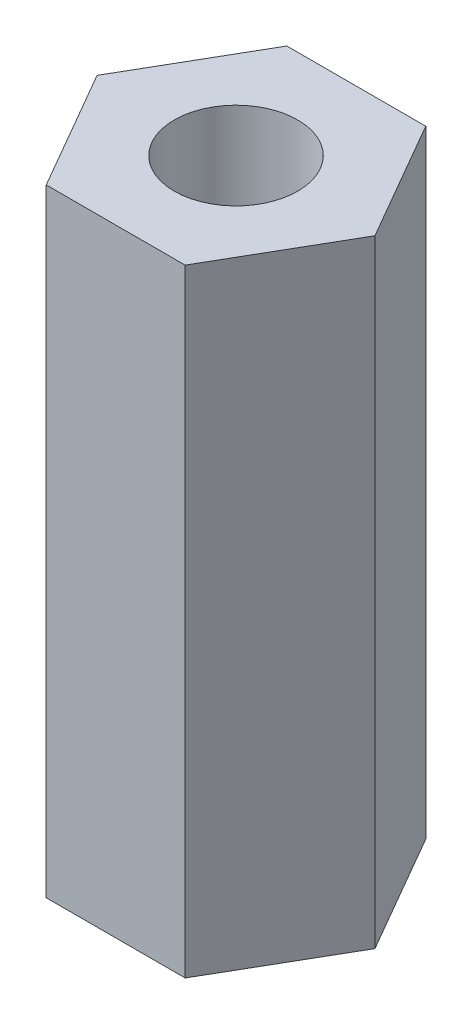
ISO-10303-21;
HEADER;
FILE_DESCRIPTION(('STEP AP214'),'2;1');
FILE_NAME('part.step','',(''),(''),'','','');
FILE_SCHEMA(('AUTOMOTIVE_DESIGN { 1 0 10303 214 1 1 1 1 }'));
ENDSEC;
DATA;
#1=APPLICATION_CONTEXT('core data for automotive mechanical design processes');
#2=APPLICATION_PROTOCOL_DEFINITION('international standard','automotive_design',2000,#1);
#3=PRODUCT_CONTEXT('',#1,'mechanical');
#4=PRODUCT('Part','Part','',(#3));
#5=PRODUCT_RELATED_PRODUCT_CATEGORY('part','',(#4));
#6=PRODUCT_DEFINITION_FORMATION('','',#4);
#7=PRODUCT_DEFINITION_CONTEXT('part definition',#1,'design');
#8=PRODUCT_DEFINITION('design','',#6,#7);
#9=PRODUCT_DEFINITION_SHAPE('','',#8);
#10=(LENGTH_UNIT() NAMED_UNIT(*) SI_UNIT(.MILLI.,.METRE.));
#11=(NAMED_UNIT(*) PLANE_ANGLE_UNIT() SI_UNIT($,.RADIAN.));
#12=(NAMED_UNIT(*) SI_UNIT($,.STERADIAN.) SOLID_ANGLE_UNIT());
#13=UNCERTAINTY_MEASURE_WITH_UNIT(LENGTH_MEASURE(1.E-05),#10,'distance_accuracy_value','');
#14=(GEOMETRIC_REPRESENTATION_CONTEXT(3) GLOBAL_UNCERTAINTY_ASSIGNED_CONTEXT((#13)) GLOBAL_UNIT_ASSIGNED_CONTEXT((#10,
#11,#12)) REPRESENTATION_CONTEXT('',''));
#15=CARTESIAN_POINT('',(0.,0.,0.));
#16=DIRECTION('',(0.,0.,1.));
#17=DIRECTION('',(1.,0.,0.));
#18=AXIS2_PLACEMENT_3D('',#15,#16,#17);
#19=CARTESIAN_POINT('',(0.,10.,0.));
#20=DIRECTION('',(0.,1.,0.));
#21=DIRECTION('',(0.,0.,1.));
#22=AXIS2_PLACEMENT_3D('',#19,#20,#21);
#23=PLANE('',#22);
#24=DIRECTION('',(0.5,0.,-0.866025403784439));
#25=VECTOR('',#24,1.);
#26=CARTESIAN_POINT('',(1.125,10.,1.94855715851499));
#27=LINE('',#26,#25);
#28=CARTESIAN_POINT('',(1.125,10.,1.94855715851499));
#29=VERTEX_POINT('',#28);
#30=CARTESIAN_POINT('',(2.25,10.,0.));
#31=VERTEX_POINT('',#30);
#32=EDGE_CURVE('E131',#29,#31,#27,.T.);
#33=ORIENTED_EDGE('',*,*,#32,.T.);
#34=DIRECTION('',(-0.5,0.,-0.866025403784438));
#35=VECTOR('',#34,1.);
#36=CARTESIAN_POINT('',(2.25,10.,0.));
#37=LINE('',#36,#35);
#38=CARTESIAN_POINT('',(1.125,10.,-1.94855715851499));
#39=VERTEX_POINT('',#38);
#40=EDGE_CURVE('E89',#31,#39,#37,.T.);
#41=ORIENTED_EDGE('',*,*,#40,.T.);
#42=DIRECTION('',(-1.,0.,0.));
#43=VECTOR('',#42,1.);
#44=CARTESIAN_POINT('',(1.125,10.,-1.94855715851499));
#45=LINE('',#44,#43);
#46=CARTESIAN_POINT('',(-1.125,10.,-1.94855715851499));
#47=VERTEX_POINT('',#46);
#48=EDGE_CURVE('E102',#39,#47,#45,.T.);
#49=ORIENTED_EDGE('',*,*,#48,.T.);
#50=DIRECTION('',(-0.5,0.,0.866025403784439));
#51=VECTOR('',#50,1.);
#52=CARTESIAN_POINT('',(-1.125,10.,-1.94855715851499));
#53=LINE('',#52,#51);
#54=CARTESIAN_POINT('',(-2.25,10.,0.));
#55=VERTEX_POINT('',#54);
#56=EDGE_CURVE('E96',#47,#55,#53,.T.);
#57=ORIENTED_EDGE('',*,*,#56,.T.);
#58=DIRECTION('',(0.5,0.,0.866025403784438));
#59=VECTOR('',#58,1.);
#60=CARTESIAN_POINT('',(-2.25,10.,0.));
#61=LINE('',#60,#59);
#62=CARTESIAN_POINT('',(-1.125,10.,1.94855715851499));
#63=VERTEX_POINT('',#62);
#64=EDGE_CURVE('E100',#55,#63,#61,.T.);
#65=ORIENTED_EDGE('',*,*,#64,.T.);
#66=DIRECTION('',(1.,0.,0.));
#67=VECTOR('',#66,1.);
#68=CARTESIAN_POINT('',(-1.125,10.,1.94855715851499));
#69=LINE('',#68,#67);
#70=EDGE_CURVE('E52',#63,#29,#69,.T.);
#71=ORIENTED_EDGE('',*,*,#70,.T.);
#72=EDGE_LOOP('',(#33,#41,#49,#57,#65,#71));
#73=FACE_BOUND('',#72,.T.);
#74=CARTESIAN_POINT('',(0.,10.,0.));
#75=DIRECTION('',(0.,1.,0.));
#76=DIRECTION('',(0.,0.,1.));
#77=AXIS2_PLACEMENT_3D('',#74,#75,#76);
#78=CIRCLE('',#77,1.);
#79=CARTESIAN_POINT('',(0.,10.,1.));
#80=VERTEX_POINT('',#79);
#81=EDGE_CURVE('E124',#80,#80,#78,.T.);
#82=ORIENTED_EDGE('',*,*,#81,.F.);
#83=EDGE_LOOP('',(#82));
#84=FACE_BOUND('',#83,.T.);
#85=ADVANCED_FACE('F35',(#73,#84),#23,.T.);
#86=CARTESIAN_POINT('',(0.,0.,0.));
#87=DIRECTION('',(0.,1.,0.));
#88=DIRECTION('',(0.,0.,1.));
#89=AXIS2_PLACEMENT_3D('',#86,#87,#88);
#90=PLANE('',#89);
#91=DIRECTION('',(0.5,0.,-0.866025403784439));
#92=VECTOR('',#91,1.);
#93=CARTESIAN_POINT('',(1.125,0.,1.94855715851499));
#94=LINE('',#93,#92);
#95=CARTESIAN_POINT('',(1.125,0.,1.94855715851499));
#96=VERTEX_POINT('',#95);
#97=CARTESIAN_POINT('',(2.25,0.,0.));
#98=VERTEX_POINT('',#97);
#99=EDGE_CURVE('E120',#96,#98,#94,.T.);
#100=ORIENTED_EDGE('',*,*,#99,.F.);
#101=DIRECTION('',(1.,0.,0.));
#102=VECTOR('',#101,1.);
#103=CARTESIAN_POINT('',(-1.125,0.,1.94855715851499));
#104=LINE('',#103,#102);
#105=CARTESIAN_POINT('',(-1.125,0.,1.94855715851499));
#106=VERTEX_POINT('',#105);
#107=EDGE_CURVE('E81',#106,#96,#104,.T.);
#108=ORIENTED_EDGE('',*,*,#107,.F.);
#109=DIRECTION('',(0.5,0.,0.866025403784438));
#110=VECTOR('',#109,1.);
#111=CARTESIAN_POINT('',(-2.25,0.,0.));
#112=LINE('',#111,#110);
#113=CARTESIAN_POINT('',(-2.25,0.,0.));
#114=VERTEX_POINT('',#113);
#115=EDGE_CURVE('E75',#114,#106,#112,.T.);
#116=ORIENTED_EDGE('',*,*,#115,.F.);
#117=DIRECTION('',(-0.5,0.,0.866025403784439));
#118=VECTOR('',#117,1.);
#119=CARTESIAN_POINT('',(-1.125,0.,-1.94855715851499));
#120=LINE('',#119,#118);
#121=CARTESIAN_POINT('',(-1.125,0.,-1.94855715851499));
#122=VERTEX_POINT('',#121);
#123=EDGE_CURVE('E110',#122,#114,#120,.T.);
#124=ORIENTED_EDGE('',*,*,#123,.F.);
#125=DIRECTION('',(-1.,0.,0.));
#126=VECTOR('',#125,1.);
#127=CARTESIAN_POINT('',(1.125,0.,-1.94855715851499));
#128=LINE('',#127,#126);
#129=CARTESIAN_POINT('',(1.125,0.,-1.94855715851499));
#130=VERTEX_POINT('',#129);
#131=EDGE_CURVE('E126',#130,#122,#128,.T.);
#132=ORIENTED_EDGE('',*,*,#131,.F.);
#133=DIRECTION('',(-0.5,0.,-0.866025403784438));
#134=VECTOR('',#133,1.);
#135=CARTESIAN_POINT('',(2.25,0.,0.));
#136=LINE('',#135,#134);
#137=EDGE_CURVE('E123',#98,#130,#136,.T.);
#138=ORIENTED_EDGE('',*,*,#137,.F.);
#139=EDGE_LOOP('',(#100,#108,#116,#124,#132,#138));
#140=FACE_BOUND('',#139,.T.);
#141=CARTESIAN_POINT('',(0.,0.,0.));
#142=DIRECTION('',(0.,1.,0.));
#143=DIRECTION('',(0.,0.,1.));
#144=AXIS2_PLACEMENT_3D('',#141,#142,#143);
#145=CIRCLE('',#144,1.);
#146=CARTESIAN_POINT('',(0.,0.,1.));
#147=VERTEX_POINT('',#146);
#148=EDGE_CURVE('E224',#147,#147,#145,.T.);
#149=ORIENTED_EDGE('',*,*,#148,.T.);
#150=EDGE_LOOP('',(#149));
#151=FACE_BOUND('',#150,.T.);
#152=ADVANCED_FACE('F140',(#140,#151),#90,.F.);
#153=CARTESIAN_POINT('',(1.125,10.,1.94855715851499));
#154=DIRECTION('',(-0.866025403784439,0.,-0.5));
#155=DIRECTION('',(-0.5,0.,0.866025403784439));
#156=AXIS2_PLACEMENT_3D('',#153,#154,#155);
#157=PLANE('',#156);
#158=ORIENTED_EDGE('',*,*,#99,.T.);
#159=DIRECTION('',(0.,-1.,0.));
#160=VECTOR('',#159,1.);
#161=CARTESIAN_POINT('',(2.25,10.,0.));
#162=LINE('',#161,#160);
#163=EDGE_CURVE('E11',#31,#98,#162,.T.);
#164=ORIENTED_EDGE('',*,*,#163,.F.);
#165=ORIENTED_EDGE('',*,*,#32,.F.);
#166=DIRECTION('',(0.,-1.,0.));
#167=VECTOR('',#166,1.);
#168=CARTESIAN_POINT('',(1.125,10.,1.94855715851499));
#169=LINE('',#168,#167);
#170=EDGE_CURVE('E116',#29,#96,#169,.T.);
#171=ORIENTED_EDGE('',*,*,#170,.T.);
#172=EDGE_LOOP('',(#158,#164,#165,#171));
#173=FACE_BOUND('',#172,.T.);
#174=ADVANCED_FACE('F37',(#173),#157,.F.);
#175=CARTESIAN_POINT('',(2.25,10.,0.));
#176=DIRECTION('',(-0.866025403784438,0.,0.5));
#177=DIRECTION('',(0.5,0.,0.866025403784439));
#178=AXIS2_PLACEMENT_3D('',#175,#176,#177);
#179=PLANE('',#178);
#180=ORIENTED_EDGE('',*,*,#137,.T.);
#181=DIRECTION('',(0.,-1.,0.));
#182=VECTOR('',#181,1.);
#183=CARTESIAN_POINT('',(1.125,10.,-1.94855715851499));
#184=LINE('',#183,#182);
#185=EDGE_CURVE('E44',#39,#130,#184,.T.);
#186=ORIENTED_EDGE('',*,*,#185,.F.);
#187=ORIENTED_EDGE('',*,*,#40,.F.);
#188=ORIENTED_EDGE('',*,*,#163,.T.);
#189=EDGE_LOOP('',(#180,#186,#187,#188));
#190=FACE_BOUND('',#189,.T.);
#191=ADVANCED_FACE('F165',(#190),#179,.F.);
#192=CARTESIAN_POINT('',(1.125,10.,-1.94855715851499));
#193=DIRECTION('',(0.,0.,1.));
#194=DIRECTION('',(1.,0.,0.));
#195=AXIS2_PLACEMENT_3D('',#192,#193,#194);
#196=PLANE('',#195);
#197=ORIENTED_EDGE('',*,*,#131,.T.);
#198=DIRECTION('',(0.,-1.,0.));
#199=VECTOR('',#198,1.);
#200=CARTESIAN_POINT('',(-1.125,10.,-1.94855715851499));
#201=LINE('',#200,#199);
#202=EDGE_CURVE('E111',#47,#122,#201,.T.);
#203=ORIENTED_EDGE('',*,*,#202,.F.);
#204=ORIENTED_EDGE('',*,*,#48,.F.);
#205=ORIENTED_EDGE('',*,*,#185,.T.);
#206=EDGE_LOOP('',(#197,#203,#204,#205));
#207=FACE_BOUND('',#206,.T.);
#208=ADVANCED_FACE('F137',(#207),#196,.F.);
#209=CARTESIAN_POINT('',(-1.125,10.,-1.94855715851499));
#210=DIRECTION('',(0.866025403784439,0.,0.5));
#211=DIRECTION('',(0.5,0.,-0.866025403784439));
#212=AXIS2_PLACEMENT_3D('',#209,#210,#211);
#213=PLANE('',#212);
#214=ORIENTED_EDGE('',*,*,#123,.T.);
#215=DIRECTION('',(0.,-1.,0.));
#216=VECTOR('',#215,1.);
#217=CARTESIAN_POINT('',(-2.25,10.,0.));
#218=LINE('',#217,#216);
#219=EDGE_CURVE('E107',#55,#114,#218,.T.);
#220=ORIENTED_EDGE('',*,*,#219,.F.);
#221=ORIENTED_EDGE('',*,*,#56,.F.);
#222=ORIENTED_EDGE('',*,*,#202,.T.);
#223=EDGE_LOOP('',(#214,#220,#221,#222));
#224=FACE_BOUND('',#223,.T.);
#225=ADVANCED_FACE('F108',(#224),#213,.F.);
#226=CARTESIAN_POINT('',(-2.25,10.,0.));
#227=DIRECTION('',(0.866025403784438,0.,-0.5));
#228=DIRECTION('',(-0.5,0.,-0.866025403784439));
#229=AXIS2_PLACEMENT_3D('',#226,#227,#228);
#230=PLANE('',#229);
#231=ORIENTED_EDGE('',*,*,#115,.T.);
#232=DIRECTION('',(0.,-1.,0.));
#233=VECTOR('',#232,1.);
#234=CARTESIAN_POINT('',(-1.125,10.,1.94855715851499));
#235=LINE('',#234,#233);
#236=EDGE_CURVE('E112',#63,#106,#235,.T.);
#237=ORIENTED_EDGE('',*,*,#236,.F.);
#238=ORIENTED_EDGE('',*,*,#64,.F.);
#239=ORIENTED_EDGE('',*,*,#219,.T.);
#240=EDGE_LOOP('',(#231,#237,#238,#239));
#241=FACE_BOUND('',#240,.T.);
#242=ADVANCED_FACE('F114',(#241),#230,.F.);
#243=CARTESIAN_POINT('',(-1.125,10.,1.94855715851499));
#244=DIRECTION('',(0.,0.,-1.));
#245=DIRECTION('',(-1.,0.,0.));
#246=AXIS2_PLACEMENT_3D('',#243,#244,#245);
#247=PLANE('',#246);
#248=ORIENTED_EDGE('',*,*,#107,.T.);
#249=ORIENTED_EDGE('',*,*,#170,.F.);
#250=ORIENTED_EDGE('',*,*,#70,.F.);
#251=ORIENTED_EDGE('',*,*,#236,.T.);
#252=EDGE_LOOP('',(#248,#249,#250,#251));
#253=FACE_BOUND('',#252,.T.);
#254=ADVANCED_FACE('F145',(#253),#247,.F.);
#255=CARTESIAN_POINT('',(0.,10.,0.));
#256=DIRECTION('',(0.,-1.,0.));
#257=DIRECTION('',(0.,0.,-1.));
#258=AXIS2_PLACEMENT_3D('',#255,#256,#257);
#259=CYLINDRICAL_SURFACE('',#258,1.);
#260=ORIENTED_EDGE('',*,*,#81,.T.);
#261=EDGE_LOOP('',(#260));
#262=FACE_BOUND('',#261,.T.);
#263=ORIENTED_EDGE('',*,*,#148,.F.);
#264=EDGE_LOOP('',(#263));
#265=FACE_BOUND('',#264,.T.);
#266=ADVANCED_FACE('F147',(#262,#265),#259,.F.);
#267=CLOSED_SHELL('',(#85,#152,#174,#191,#208,#225,#242,#254,#266));
#268=MANIFOLD_SOLID_BREP('B2',#267);
#269=ADVANCED_BREP_SHAPE_REPRESENTATION('',(#18,#268),#14);
#270=SHAPE_DEFINITION_REPRESENTATION(#9,#269);
ENDSEC;
END-ISO-10303-21;
